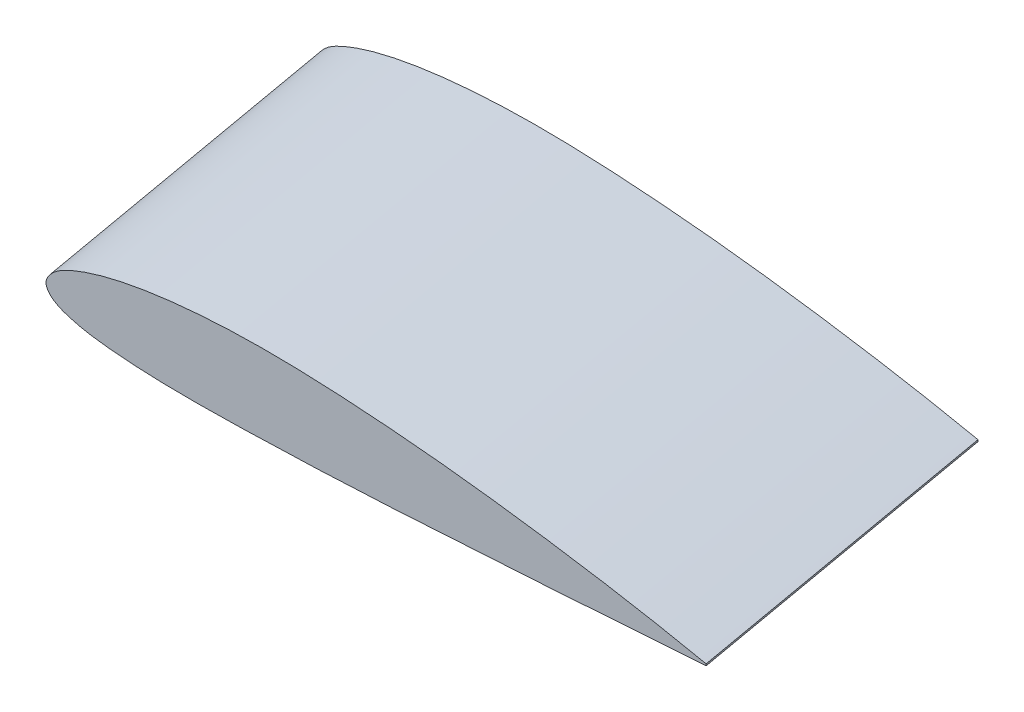
ISO-10303-21;
HEADER;
FILE_DESCRIPTION(('STEP AP214'),'2;1');
FILE_NAME('part.step','',(''),(''),'','','');
FILE_SCHEMA(('AUTOMOTIVE_DESIGN { 1 0 10303 214 1 1 1 1 }'));
ENDSEC;
DATA;
#1=APPLICATION_CONTEXT('core data for automotive mechanical design processes');
#2=APPLICATION_PROTOCOL_DEFINITION('international standard','automotive_design',2000,#1);
#3=PRODUCT_CONTEXT('',#1,'mechanical');
#4=PRODUCT('Part','Part','',(#3));
#5=PRODUCT_RELATED_PRODUCT_CATEGORY('part','',(#4));
#6=PRODUCT_DEFINITION_FORMATION('','',#4);
#7=PRODUCT_DEFINITION_CONTEXT('part definition',#1,'design');
#8=PRODUCT_DEFINITION('design','',#6,#7);
#9=PRODUCT_DEFINITION_SHAPE('','',#8);
#10=(LENGTH_UNIT() NAMED_UNIT(*) SI_UNIT(.MILLI.,.METRE.));
#11=(NAMED_UNIT(*) PLANE_ANGLE_UNIT() SI_UNIT($,.RADIAN.));
#12=(NAMED_UNIT(*) SI_UNIT($,.STERADIAN.) SOLID_ANGLE_UNIT());
#13=UNCERTAINTY_MEASURE_WITH_UNIT(LENGTH_MEASURE(1.E-05),#10,'distance_accuracy_value','');
#14=(GEOMETRIC_REPRESENTATION_CONTEXT(3) GLOBAL_UNCERTAINTY_ASSIGNED_CONTEXT((#13)) GLOBAL_UNIT_ASSIGNED_CONTEXT((#10,
#11,#12)) REPRESENTATION_CONTEXT('',''));
#15=CARTESIAN_POINT('',(0.,0.,0.));
#16=DIRECTION('',(0.,0.,1.));
#17=DIRECTION('',(1.,0.,0.));
#18=AXIS2_PLACEMENT_3D('',#15,#16,#17);
#19=CARTESIAN_POINT('',(371.205825698085,13.5042645892697,311.983011187805));
#20=DIRECTION('',(0.,0.,-1.));
#21=DIRECTION('',(-1.,0.,0.));
#22=AXIS2_PLACEMENT_3D('',#19,#20,#21);
#23=PLANE('',#22);
#24=CARTESIAN_POINT('',(618.920556441424,12.0636297095412,311.983011187805));
#25=CARTESIAN_POINT('',(610.172786080793,13.8925859135704,311.983011187805));
#26=CARTESIAN_POINT('',(596.636464620132,16.5257798418035,311.983011187805));
#27=CARTESIAN_POINT('',(578.977457907226,19.5328413100797,311.983011187805));
#28=CARTESIAN_POINT('',(564.311149484954,21.8383166356723,311.983011187805));
#29=CARTESIAN_POINT('',(549.711730679347,23.9325733669788,311.983011187805));
#30=CARTESIAN_POINT('',(533.908362972147,25.9645290460585,311.983011187805));
#31=CARTESIAN_POINT('',(518.564503092253,27.6883368933876,311.983011187805));
#32=CARTESIAN_POINT('',(501.333712200275,29.2631641324657,311.983011187805));
#33=CARTESIAN_POINT('',(484.620820277038,30.4569246958566,311.983011187805));
#34=CARTESIAN_POINT('',(468.562584540773,31.2042388715018,311.983011187805));
#35=CARTESIAN_POINT('',(453.349338244621,31.4877723546738,311.983011187805));
#36=CARTESIAN_POINT('',(439.706327048377,31.2001337932332,311.983011187805));
#37=CARTESIAN_POINT('',(425.054362673083,30.2833495263879,311.983011187805));
#38=CARTESIAN_POINT('',(412.451857976505,28.9295003078746,311.983011187805));
#39=CARTESIAN_POINT('',(398.771148713661,26.5674808733691,311.983011187805));
#40=CARTESIAN_POINT('',(388.194710466502,23.8671471405236,311.983011187805));
#41=CARTESIAN_POINT('',(380.077093644353,20.7832177263112,311.983011187805));
#42=CARTESIAN_POINT('',(375.688958719588,18.4393812381243,311.983011187805));
#43=CARTESIAN_POINT('',(373.46155106277,16.640003059533,311.983011187805));
#44=CARTESIAN_POINT('',(372.264041889618,15.3476777212937,311.983011187805));
#45=CARTESIAN_POINT('',(371.224897362401,13.7937145960401,311.983011187805));
#46=CARTESIAN_POINT('',(370.644350538392,11.9048851085942,311.983011187805));
#47=CARTESIAN_POINT('',(371.617065566659,9.69908550021878,311.983011187805));
#48=CARTESIAN_POINT('',(373.442866318877,7.90366359062156,311.983011187805));
#49=CARTESIAN_POINT('',(376.528152402367,6.1932098425297,311.983011187805));
#50=CARTESIAN_POINT('',(380.658220953292,4.88388986735925,311.983011187805));
#51=CARTESIAN_POINT('',(386.634930146765,3.49206542346206,311.983011187805));
#52=CARTESIAN_POINT('',(394.803194734209,2.4509815251869,311.983011187805));
#53=CARTESIAN_POINT('',(405.923518092551,1.58149619298012,311.983011187805));
#54=CARTESIAN_POINT('',(425.663876491936,0.996089657128013,311.983011187805));
#55=CARTESIAN_POINT('',(449.301957296686,1.57374177892315,311.983011187805));
#56=CARTESIAN_POINT('',(477.317469270969,2.54455181412631,311.983011187805));
#57=CARTESIAN_POINT('',(503.18682368946,3.86119609185388,311.983011187805));
#58=CARTESIAN_POINT('',(530.641084123334,5.5711814878458,311.983011187805));
#59=CARTESIAN_POINT('',(569.311857095576,7.95864045531972,311.983011187805));
#60=CARTESIAN_POINT('',(598.691085877884,10.0332148203693,311.983011187805));
#61=CARTESIAN_POINT('',(618.920556441424,11.4188297095412,311.983011187805));
#62=B_SPLINE_CURVE_WITH_KNOTS('',3,(#24,#25,#26,#27,#28,#29,#30,#31,#32,#33,#34,#35,#36,#37,#38,
#39,#40,#41,#42,#43,#44,#45,#46,#47,#48,#49,#50,#51,#52,#53,#54,#55,#56,#57,#58,#59,#60,#61),
.UNSPECIFIED.,.F.,.F.,(4,1,1,1,1,1,1,1,1,1,1,1,1,1,1,1,1,1,1,1,1,1,1,1,1,1,1,1,1,1,1,1,1,1,1,4),
(0.,0.0529779391463821,0.0817376929006658,0.106185234973789,0.140986133995364,0.169165020792295,
0.200636479193826,0.232510831816366,0.271729305578374,0.299952701904088,0.327797668599624,
0.361916964403109,0.380808038678929,0.41481836461567,0.436985824410233,0.463079119766163,
0.47936862310597,0.488396004965109,0.492389735137145,0.496304197310246,0.49876184562352,
0.503522343620652,0.507143868904807,0.512430572383014,0.518483882496799,0.527880831347698,
0.538020027147716,0.554844217138109,0.576615116920705,0.604140075436629,0.671866348914674,
0.71673244156722,0.770323553556591,0.825408654056713,0.879797678944327,1.),.UNSPECIFIED.);
#63=CARTESIAN_POINT('',(618.920556441424,12.0636297095412,311.983011187805));
#64=VERTEX_POINT('',#63);
#65=CARTESIAN_POINT('',(618.920556441424,11.4188297095412,311.983011187805));
#66=VERTEX_POINT('',#65);
#67=EDGE_CURVE('E44',#64,#66,#62,.T.);
#68=ORIENTED_EDGE('',*,*,#67,.T.);
#69=DIRECTION('',(0.,1.,0.));
#70=VECTOR('',#69,1.);
#71=CARTESIAN_POINT('',(618.920556441424,12.0636297095412,311.983011187805));
#72=LINE('',#71,#70);
#73=EDGE_CURVE('E11',#66,#64,#72,.T.);
#74=ORIENTED_EDGE('',*,*,#73,.T.);
#75=EDGE_LOOP('',(#68,#74));
#76=FACE_BOUND('',#75,.T.);
#77=ADVANCED_FACE('F37',(#76),#23,.F.);
#78=CARTESIAN_POINT('',(349.341280090243,13.5042645892697,187.983011187805));
#79=DIRECTION('',(0.,0.,-1.));
#80=DIRECTION('',(-1.,0.,0.));
#81=AXIS2_PLACEMENT_3D('',#78,#79,#80);
#82=PLANE('',#81);
#83=CARTESIAN_POINT('',(597.056010833582,12.0636297095412,187.983011187805));
#84=CARTESIAN_POINT('',(588.308240472952,13.8925859135704,187.983011187805));
#85=CARTESIAN_POINT('',(574.77191901229,16.5257798418035,187.983011187805));
#86=CARTESIAN_POINT('',(557.112912299384,19.5328413100797,187.983011187805));
#87=CARTESIAN_POINT('',(542.446603877113,21.8383166356722,187.983011187805));
#88=CARTESIAN_POINT('',(527.847185071506,23.9325733669787,187.983011187805));
#89=CARTESIAN_POINT('',(512.043817364305,25.9645290460585,187.983011187805));
#90=CARTESIAN_POINT('',(496.699957484411,27.6883368933876,187.983011187805));
#91=CARTESIAN_POINT('',(479.469166592433,29.2631641324657,187.983011187805));
#92=CARTESIAN_POINT('',(462.756274669197,30.4569246958566,187.983011187805));
#93=CARTESIAN_POINT('',(446.698038932932,31.2042388715018,187.983011187805));
#94=CARTESIAN_POINT('',(431.484792636779,31.4877723546738,187.983011187805));
#95=CARTESIAN_POINT('',(417.841781440536,31.2001337932332,187.983011187805));
#96=CARTESIAN_POINT('',(403.189817065241,30.2833495263879,187.983011187805));
#97=CARTESIAN_POINT('',(390.587312368663,28.9295003078747,187.983011187805));
#98=CARTESIAN_POINT('',(376.906603105819,26.567480873369,187.983011187805));
#99=CARTESIAN_POINT('',(366.33016485866,23.8671471405236,187.983011187805));
#100=CARTESIAN_POINT('',(358.212548036511,20.7832177263111,187.983011187805));
#101=CARTESIAN_POINT('',(353.824413111747,18.4393812381243,187.983011187805));
#102=CARTESIAN_POINT('',(351.597005454929,16.640003059533,187.983011187805));
#103=CARTESIAN_POINT('',(350.399496281776,15.3476777212937,187.983011187805));
#104=CARTESIAN_POINT('',(349.360351754559,13.79371459604,187.983011187805));
#105=CARTESIAN_POINT('',(348.779804930551,11.9048851085943,187.983011187805));
#106=CARTESIAN_POINT('',(349.752519958817,9.6990855002187,187.983011187805));
#107=CARTESIAN_POINT('',(351.578320711036,7.90366359062163,187.983011187805));
#108=CARTESIAN_POINT('',(354.663606794525,6.19320984252966,187.983011187805));
#109=CARTESIAN_POINT('',(358.79367534545,4.88388986735927,187.983011187805));
#110=CARTESIAN_POINT('',(364.770384538924,3.49206542346201,187.983011187805));
#111=CARTESIAN_POINT('',(372.938649126368,2.4509815251869,187.983011187805));
#112=CARTESIAN_POINT('',(384.05897248471,1.5814961929801,187.983011187805));
#113=CARTESIAN_POINT('',(403.799330884094,0.996089657128013,187.983011187805));
#114=CARTESIAN_POINT('',(427.437411688844,1.57374177892315,187.983011187805));
#115=CARTESIAN_POINT('',(455.452923663128,2.5445518141263,187.983011187805));
#116=CARTESIAN_POINT('',(481.322278081619,3.86119609185387,187.983011187805));
#117=CARTESIAN_POINT('',(508.776538515493,5.5711814878458,187.983011187805));
#118=CARTESIAN_POINT('',(547.447311487734,7.95864045531973,187.983011187805));
#119=CARTESIAN_POINT('',(576.826540270043,10.0332148203693,187.983011187805));
#120=CARTESIAN_POINT('',(597.056010833582,11.4188297095412,187.983011187805));
#121=B_SPLINE_CURVE_WITH_KNOTS('',3,(#83,#84,#85,#86,#87,#88,#89,#90,#91,#92,#93,#94,#95,#96,
#97,#98,#99,#100,#101,#102,#103,#104,#105,#106,#107,#108,#109,#110,#111,#112,#113,#114,#115,
#116,#117,#118,#119,#120),.UNSPECIFIED.,.F.,.F.,(4,1,1,1,1,1,1,1,1,1,1,1,1,1,1,1,1,1,1,1,1,1,1,
1,1,1,1,1,1,1,1,1,1,1,1,4),(0.,0.0529779391463818,0.0817376929006654,0.106185234973789,
0.140986133995364,0.169165020792293,0.200636479193825,0.232510831816365,0.271729305578374,
0.299952701904087,0.327797668599622,0.361916964403109,0.380808038678929,0.41481836461567,
0.436985824410233,0.463079119766163,0.47936862310597,0.488396004965109,0.492389735137145,
0.496304197310246,0.49876184562352,0.503522343620652,0.507143868904807,0.512430572383014,
0.518483882496799,0.527880831347698,0.538020027147716,0.554844217138109,0.576615116920705,
0.604140075436629,0.671866348914674,0.71673244156722,0.770323553556591,0.825408654056714,
0.879797678944328,1.),.UNSPECIFIED.);
#122=CARTESIAN_POINT('',(597.056010833582,12.0636297095412,187.983011187805));
#123=VERTEX_POINT('',#122);
#124=CARTESIAN_POINT('',(597.056010833582,11.4188297095412,187.983011187805));
#125=VERTEX_POINT('',#124);
#126=EDGE_CURVE('E65',#123,#125,#121,.T.);
#127=ORIENTED_EDGE('',*,*,#126,.F.);
#128=DIRECTION('',(0.,1.,0.));
#129=VECTOR('',#128,1.);
#130=CARTESIAN_POINT('',(597.056010833582,12.0636297095412,187.983011187805));
#131=LINE('',#130,#129);
#132=EDGE_CURVE('E68',#125,#123,#131,.T.);
#133=ORIENTED_EDGE('',*,*,#132,.F.);
#134=EDGE_LOOP('',(#127,#133));
#135=FACE_BOUND('',#134,.T.);
#136=ADVANCED_FACE('F73',(#135),#82,.T.);
#137=CARTESIAN_POINT('',(589.57789581104,11.7412297095412,145.572513415436));
#138=DIRECTION('',(-0.984807753012219,0.,0.173648177666869));
#139=DIRECTION('',(0.173648177666869,0.,0.984807753012219));
#140=AXIS2_PLACEMENT_3D('',#137,#138,#139);
#141=PLANE('',#140);
#142=DIRECTION('',(0.173648177666869,0.,0.984807753012219));
#143=VECTOR('',#142,1.);
#144=CARTESIAN_POINT('',(597.056010833582,12.0636297095412,187.983011187805));
#145=LINE('',#144,#143);
#146=EDGE_CURVE('E61',#123,#64,#145,.T.);
#147=ORIENTED_EDGE('',*,*,#146,.T.);
#148=ORIENTED_EDGE('',*,*,#73,.F.);
#149=DIRECTION('',(0.173648177666869,0.,0.984807753012219));
#150=VECTOR('',#149,1.);
#151=CARTESIAN_POINT('',(597.056010833582,11.4188297095412,187.983011187805));
#152=LINE('',#151,#150);
#153=EDGE_CURVE('E51',#125,#66,#152,.T.);
#154=ORIENTED_EDGE('',*,*,#153,.F.);
#155=ORIENTED_EDGE('',*,*,#132,.T.);
#156=EDGE_LOOP('',(#147,#148,#154,#155));
#157=FACE_BOUND('',#156,.T.);
#158=ADVANCED_FACE('F70',(#157),#141,.F.);
#159=CARTESIAN_POINT('',(597.056010833582,12.0636297095412,187.983011187805));
#160=CARTESIAN_POINT('',(618.920556441424,12.0636297095412,311.983011187805));
#161=CARTESIAN_POINT('',(588.308240472952,13.8925859135704,187.983011187805));
#162=CARTESIAN_POINT('',(610.172786080793,13.8925859135704,311.983011187805));
#163=CARTESIAN_POINT('',(574.77191901229,16.5257798418035,187.983011187805));
#164=CARTESIAN_POINT('',(596.636464620132,16.5257798418035,311.983011187805));
#165=CARTESIAN_POINT('',(557.112912299384,19.5328413100797,187.983011187805));
#166=CARTESIAN_POINT('',(578.977457907226,19.5328413100797,311.983011187805));
#167=CARTESIAN_POINT('',(542.446603877113,21.8383166356722,187.983011187805));
#168=CARTESIAN_POINT('',(564.311149484954,21.8383166356723,311.983011187805));
#169=CARTESIAN_POINT('',(527.847185071506,23.9325733669787,187.983011187805));
#170=CARTESIAN_POINT('',(549.711730679347,23.9325733669788,311.983011187805));
#171=CARTESIAN_POINT('',(512.043817364305,25.9645290460585,187.983011187805));
#172=CARTESIAN_POINT('',(533.908362972147,25.9645290460585,311.983011187805));
#173=CARTESIAN_POINT('',(496.699957484411,27.6883368933876,187.983011187805));
#174=CARTESIAN_POINT('',(518.564503092253,27.6883368933876,311.983011187805));
#175=CARTESIAN_POINT('',(479.469166592433,29.2631641324657,187.983011187805));
#176=CARTESIAN_POINT('',(501.333712200275,29.2631641324657,311.983011187805));
#177=CARTESIAN_POINT('',(462.756274669197,30.4569246958566,187.983011187805));
#178=CARTESIAN_POINT('',(484.620820277038,30.4569246958566,311.983011187805));
#179=CARTESIAN_POINT('',(446.698038932932,31.2042388715018,187.983011187805));
#180=CARTESIAN_POINT('',(468.562584540773,31.2042388715018,311.983011187805));
#181=CARTESIAN_POINT('',(431.484792636779,31.4877723546738,187.983011187805));
#182=CARTESIAN_POINT('',(453.349338244621,31.4877723546738,311.983011187805));
#183=CARTESIAN_POINT('',(417.841781440536,31.2001337932332,187.983011187805));
#184=CARTESIAN_POINT('',(439.706327048377,31.2001337932332,311.983011187805));
#185=CARTESIAN_POINT('',(403.189817065241,30.2833495263879,187.983011187805));
#186=CARTESIAN_POINT('',(425.054362673083,30.2833495263879,311.983011187805));
#187=CARTESIAN_POINT('',(390.587312368663,28.9295003078747,187.983011187805));
#188=CARTESIAN_POINT('',(412.451857976505,28.9295003078746,311.983011187805));
#189=CARTESIAN_POINT('',(376.906603105819,26.567480873369,187.983011187805));
#190=CARTESIAN_POINT('',(398.771148713661,26.5674808733691,311.983011187805));
#191=CARTESIAN_POINT('',(366.33016485866,23.8671471405236,187.983011187805));
#192=CARTESIAN_POINT('',(388.194710466502,23.8671471405236,311.983011187805));
#193=CARTESIAN_POINT('',(358.212548036511,20.7832177263111,187.983011187805));
#194=CARTESIAN_POINT('',(380.077093644353,20.7832177263112,311.983011187805));
#195=CARTESIAN_POINT('',(353.824413111747,18.4393812381243,187.983011187805));
#196=CARTESIAN_POINT('',(375.688958719588,18.4393812381243,311.983011187805));
#197=CARTESIAN_POINT('',(351.597005454929,16.640003059533,187.983011187805));
#198=CARTESIAN_POINT('',(373.46155106277,16.640003059533,311.983011187805));
#199=CARTESIAN_POINT('',(350.399496281776,15.3476777212937,187.983011187805));
#200=CARTESIAN_POINT('',(372.264041889618,15.3476777212937,311.983011187805));
#201=CARTESIAN_POINT('',(349.360351754559,13.79371459604,187.983011187805));
#202=CARTESIAN_POINT('',(371.224897362401,13.7937145960401,311.983011187805));
#203=CARTESIAN_POINT('',(348.779804930551,11.9048851085943,187.983011187805));
#204=CARTESIAN_POINT('',(370.644350538392,11.9048851085942,311.983011187805));
#205=CARTESIAN_POINT('',(349.752519958817,9.6990855002187,187.983011187805));
#206=CARTESIAN_POINT('',(371.617065566659,9.69908550021878,311.983011187805));
#207=CARTESIAN_POINT('',(351.578320711036,7.90366359062163,187.983011187805));
#208=CARTESIAN_POINT('',(373.442866318877,7.90366359062156,311.983011187805));
#209=CARTESIAN_POINT('',(354.663606794525,6.19320984252966,187.983011187805));
#210=CARTESIAN_POINT('',(376.528152402367,6.1932098425297,311.983011187805));
#211=CARTESIAN_POINT('',(358.79367534545,4.88388986735927,187.983011187805));
#212=CARTESIAN_POINT('',(380.658220953292,4.88388986735925,311.983011187805));
#213=CARTESIAN_POINT('',(364.770384538924,3.49206542346201,187.983011187805));
#214=CARTESIAN_POINT('',(386.634930146765,3.49206542346206,311.983011187805));
#215=CARTESIAN_POINT('',(372.938649126368,2.4509815251869,187.983011187805));
#216=CARTESIAN_POINT('',(394.803194734209,2.4509815251869,311.983011187805));
#217=CARTESIAN_POINT('',(384.05897248471,1.5814961929801,187.983011187805));
#218=CARTESIAN_POINT('',(405.923518092551,1.58149619298012,311.983011187805));
#219=CARTESIAN_POINT('',(403.799330884094,0.996089657128013,187.983011187805));
#220=CARTESIAN_POINT('',(425.663876491936,0.996089657128013,311.983011187805));
#221=CARTESIAN_POINT('',(427.437411688844,1.57374177892315,187.983011187805));
#222=CARTESIAN_POINT('',(449.301957296686,1.57374177892315,311.983011187805));
#223=CARTESIAN_POINT('',(455.452923663128,2.5445518141263,187.983011187805));
#224=CARTESIAN_POINT('',(477.317469270969,2.54455181412631,311.983011187805));
#225=CARTESIAN_POINT('',(481.322278081619,3.86119609185387,187.983011187805));
#226=CARTESIAN_POINT('',(503.18682368946,3.86119609185388,311.983011187805));
#227=CARTESIAN_POINT('',(508.776538515493,5.5711814878458,187.983011187805));
#228=CARTESIAN_POINT('',(530.641084123334,5.5711814878458,311.983011187805));
#229=CARTESIAN_POINT('',(547.447311487734,7.95864045531973,187.983011187805));
#230=CARTESIAN_POINT('',(569.311857095576,7.95864045531972,311.983011187805));
#231=CARTESIAN_POINT('',(576.826540270043,10.0332148203693,187.983011187805));
#232=CARTESIAN_POINT('',(598.691085877884,10.0332148203693,311.983011187805));
#233=CARTESIAN_POINT('',(597.056010833582,11.4188297095412,187.983011187805));
#234=CARTESIAN_POINT('',(618.920556441424,11.4188297095412,311.983011187805));
#235=B_SPLINE_SURFACE_WITH_KNOTS('',3,1,((#159,#160),(#161,#162),(#163,#164),(#165,#166),(#167,
#168),(#169,#170),(#171,#172),(#173,#174),(#175,#176),(#177,#178),(#179,#180),(#181,#182),(#183,
#184),(#185,#186),(#187,#188),(#189,#190),(#191,#192),(#193,#194),(#195,#196),(#197,#198),(#199,
#200),(#201,#202),(#203,#204),(#205,#206),(#207,#208),(#209,#210),(#211,#212),(#213,#214),(#215,
#216),(#217,#218),(#219,#220),(#221,#222),(#223,#224),(#225,#226),(#227,#228),(#229,#230),(#231,
#232),(#233,#234)),.UNSPECIFIED.,.F.,.F.,.F.,(4,1,1,1,1,1,1,1,1,1,1,1,1,1,1,1,1,1,1,1,1,1,1,1,1,
1,1,1,1,1,1,1,1,1,1,4),(2,2),(0.,0.0529779391463818,0.0817376929006654,0.106185234973789,
0.140986133995364,0.169165020792293,0.200636479193825,0.232510831816365,0.271729305578374,
0.299952701904087,0.327797668599622,0.361916964403109,0.380808038678929,0.41481836461567,
0.436985824410233,0.463079119766163,0.47936862310597,0.488396004965109,0.492389735137145,
0.496304197310246,0.49876184562352,0.503522343620652,0.507143868904807,0.512430572383014,
0.518483882496799,0.527880831347698,0.538020027147716,0.554844217138109,0.576615116920705,
0.604140075436629,0.671866348914674,0.71673244156722,0.770323553556591,0.825408654056714,
0.879797678944328,1.),(0.,1.),.UNSPECIFIED.);
#236=ORIENTED_EDGE('',*,*,#126,.T.);
#237=ORIENTED_EDGE('',*,*,#153,.T.);
#238=ORIENTED_EDGE('',*,*,#67,.F.);
#239=ORIENTED_EDGE('',*,*,#146,.F.);
#240=EDGE_LOOP('',(#236,#237,#238,#239));
#241=FACE_BOUND('',#240,.T.);
#242=ADVANCED_FACE('F63',(#241),#235,.T.);
#243=CLOSED_SHELL('',(#77,#136,#158,#242));
#244=MANIFOLD_SOLID_BREP('B2',#243);
#245=ADVANCED_BREP_SHAPE_REPRESENTATION('',(#18,#244),#14);
#246=SHAPE_DEFINITION_REPRESENTATION(#9,#245);
ENDSEC;
END-ISO-10303-21;
